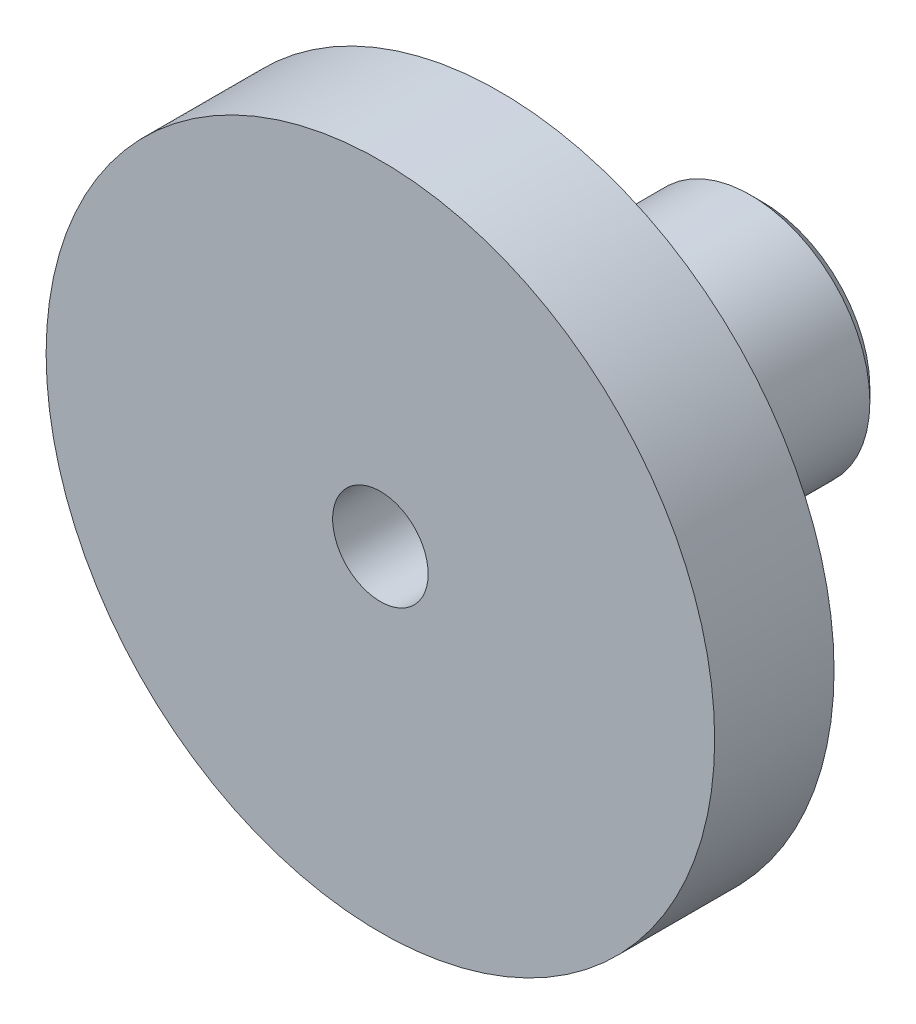
ISO-10303-21;
HEADER;
FILE_DESCRIPTION(('STEP AP214'),'2;1');
FILE_NAME('part.step','',(''),(''),'','','');
FILE_SCHEMA(('AUTOMOTIVE_DESIGN { 1 0 10303 214 1 1 1 1 }'));
ENDSEC;
DATA;
#1=APPLICATION_CONTEXT('core data for automotive mechanical design processes');
#2=APPLICATION_PROTOCOL_DEFINITION('international standard','automotive_design',2000,#1);
#3=PRODUCT_CONTEXT('',#1,'mechanical');
#4=PRODUCT('Part','Part','',(#3));
#5=PRODUCT_RELATED_PRODUCT_CATEGORY('part','',(#4));
#6=PRODUCT_DEFINITION_FORMATION('','',#4);
#7=PRODUCT_DEFINITION_CONTEXT('part definition',#1,'design');
#8=PRODUCT_DEFINITION('design','',#6,#7);
#9=PRODUCT_DEFINITION_SHAPE('','',#8);
#10=(LENGTH_UNIT() NAMED_UNIT(*) SI_UNIT(.MILLI.,.METRE.));
#11=(NAMED_UNIT(*) PLANE_ANGLE_UNIT() SI_UNIT($,.RADIAN.));
#12=(NAMED_UNIT(*) SI_UNIT($,.STERADIAN.) SOLID_ANGLE_UNIT());
#13=UNCERTAINTY_MEASURE_WITH_UNIT(LENGTH_MEASURE(1.E-05),#10,'distance_accuracy_value','');
#14=(GEOMETRIC_REPRESENTATION_CONTEXT(3) GLOBAL_UNCERTAINTY_ASSIGNED_CONTEXT((#13)) GLOBAL_UNIT_ASSIGNED_CONTEXT((#10,
#11,#12)) REPRESENTATION_CONTEXT('',''));
#15=CARTESIAN_POINT('',(0.,0.,0.));
#16=DIRECTION('',(0.,0.,1.));
#17=DIRECTION('',(1.,0.,0.));
#18=AXIS2_PLACEMENT_3D('',#15,#16,#17);
#19=CARTESIAN_POINT('',(0.,0.,-10.));
#20=DIRECTION('',(0.,0.,1.));
#21=DIRECTION('',(-1.,0.,0.));
#22=AXIS2_PLACEMENT_3D('',#19,#20,#21);
#23=CYLINDRICAL_SURFACE('',#22,28.);
#24=CARTESIAN_POINT('',(0.,0.,-10.));
#25=DIRECTION('',(0.,0.,1.));
#26=DIRECTION('',(1.,0.,0.));
#27=AXIS2_PLACEMENT_3D('',#24,#25,#26);
#28=CIRCLE('',#27,28.);
#29=CARTESIAN_POINT('',(28.,0.,-10.));
#30=VERTEX_POINT('',#29);
#31=EDGE_CURVE('E63',#30,#30,#28,.T.);
#32=ORIENTED_EDGE('',*,*,#31,.T.);
#33=EDGE_LOOP('',(#32));
#34=FACE_BOUND('',#33,.T.);
#35=CARTESIAN_POINT('',(0.,0.,0.));
#36=DIRECTION('',(0.,0.,1.));
#37=DIRECTION('',(1.,0.,0.));
#38=AXIS2_PLACEMENT_3D('',#35,#36,#37);
#39=CIRCLE('',#38,28.);
#40=CARTESIAN_POINT('',(28.,0.,0.));
#41=VERTEX_POINT('',#40);
#42=EDGE_CURVE('E64',#41,#41,#39,.T.);
#43=ORIENTED_EDGE('',*,*,#42,.F.);
#44=EDGE_LOOP('',(#43));
#45=FACE_BOUND('',#44,.T.);
#46=ADVANCED_FACE('F37',(#34,#45),#23,.T.);
#47=CARTESIAN_POINT('',(0.,0.,-10.));
#48=DIRECTION('',(0.,0.,-1.));
#49=DIRECTION('',(1.,0.,0.));
#50=AXIS2_PLACEMENT_3D('',#47,#48,#49);
#51=PLANE('',#50);
#52=CARTESIAN_POINT('',(0.,0.,-10.));
#53=DIRECTION('',(0.,0.,1.));
#54=DIRECTION('',(1.,0.,0.));
#55=AXIS2_PLACEMENT_3D('',#52,#53,#54);
#56=CIRCLE('',#55,11.);
#57=CARTESIAN_POINT('',(11.,0.,-10.));
#58=VERTEX_POINT('',#57);
#59=EDGE_CURVE('E10',#58,#58,#56,.F.);
#60=ORIENTED_EDGE('',*,*,#59,.F.);
#61=EDGE_LOOP('',(#60));
#62=FACE_BOUND('',#61,.T.);
#63=ORIENTED_EDGE('',*,*,#31,.F.);
#64=EDGE_LOOP('',(#63));
#65=FACE_BOUND('',#64,.T.);
#66=ADVANCED_FACE('F98',(#62,#65),#51,.T.);
#67=CARTESIAN_POINT('',(0.,0.,0.));
#68=DIRECTION('',(0.,0.,-1.));
#69=DIRECTION('',(1.,0.,0.));
#70=AXIS2_PLACEMENT_3D('',#67,#68,#69);
#71=PLANE('',#70);
#72=CARTESIAN_POINT('',(0.,0.,0.));
#73=DIRECTION('',(0.,0.,1.));
#74=DIRECTION('',(1.,0.,0.));
#75=AXIS2_PLACEMENT_3D('',#72,#73,#74);
#76=CIRCLE('',#75,4.);
#77=CARTESIAN_POINT('',(4.,0.,0.));
#78=VERTEX_POINT('',#77);
#79=EDGE_CURVE('E67',#78,#78,#76,.T.);
#80=ORIENTED_EDGE('',*,*,#79,.F.);
#81=EDGE_LOOP('',(#80));
#82=FACE_BOUND('',#81,.T.);
#83=ORIENTED_EDGE('',*,*,#42,.T.);
#84=EDGE_LOOP('',(#83));
#85=FACE_BOUND('',#84,.T.);
#86=ADVANCED_FACE('F95',(#82,#85),#71,.F.);
#87=CARTESIAN_POINT('',(0.,0.,-32.));
#88=DIRECTION('',(0.,0.,1.));
#89=DIRECTION('',(-1.,0.,0.));
#90=AXIS2_PLACEMENT_3D('',#87,#88,#89);
#91=CYLINDRICAL_SURFACE('',#90,10.);
#92=CARTESIAN_POINT('',(10.,0.,-20.35));
#93=CARTESIAN_POINT('',(9.99999843258099,-0.0920114531057513,-20.3500037009853));
#94=CARTESIAN_POINT('',(9.99871684765511,-0.184073454347173,-20.3577224586854));
#95=CARTESIAN_POINT('',(9.99372775496381,-0.36561632253533,-20.3883812351379));
#96=CARTESIAN_POINT('',(9.99001800272159,-0.455094721351769,-20.4113353369588));
#97=CARTESIAN_POINT('',(9.98058875631552,-0.628817487751617,-20.4717536389359));
#98=CARTESIAN_POINT('',(9.974870893487,-0.713066038744489,-20.5092060635603));
#99=CARTESIAN_POINT('',(9.96205444853338,-0.874072236504047,-20.5975272541486));
#100=CARTESIAN_POINT('',(9.95495602786423,-0.950830757653335,-20.648394451505));
#101=CARTESIAN_POINT('',(9.9400912001718,-1.09540879372213,-20.7626087771329));
#102=CARTESIAN_POINT('',(9.93231968689365,-1.1631478788234,-20.8260570636182));
#103=CARTESIAN_POINT('',(9.91702374723339,-1.28706950777736,-20.9634147735932));
#104=CARTESIAN_POINT('',(9.90949933632427,-1.3432513290959,-21.0373248506432));
#105=CARTESIAN_POINT('',(9.89550007731641,-1.44278500045255,-21.1940593436766));
#106=CARTESIAN_POINT('',(9.88903182722124,-1.486057495709,-21.2769347943439));
#107=CARTESIAN_POINT('',(9.87794796970923,-1.55803674048926,-21.4489026252365));
#108=CARTESIAN_POINT('',(9.87333223970889,-1.58674445381558,-21.5379945936492));
#109=CARTESIAN_POINT('',(9.86652679242373,-1.62852619503012,-21.719014582001));
#110=CARTESIAN_POINT('',(9.86431555933323,-1.64173895927954,-21.8109097556787));
#111=CARTESIAN_POINT('',(9.86250435770822,-1.6525858553069,-21.9956373659234));
#112=CARTESIAN_POINT('',(9.86290420804218,-1.65022106770363,-22.0884697370306));
#113=CARTESIAN_POINT('',(9.86625034802631,-1.63009303176281,-22.2714472770567));
#114=CARTESIAN_POINT('',(9.86917088684506,-1.61248549472491,-22.3616101140273));
#115=CARTESIAN_POINT('',(9.87718903199042,-1.56261607367814,-22.5376840705334));
#116=CARTESIAN_POINT('',(9.88228671162732,-1.53035369619842,-22.6235950467882));
#117=CARTESIAN_POINT('',(9.89411264039673,-1.45193210975576,-22.7891935299244));
#118=CARTESIAN_POINT('',(9.90084846298693,-1.40570810605855,-22.8688497892407));
#119=CARTESIAN_POINT('',(9.91518643931069,-1.30072141548382,-23.0193343239077));
#120=CARTESIAN_POINT('',(9.92278866158315,-1.24195773629992,-23.0901618999123));
#121=CARTESIAN_POINT('',(9.93811607123993,-1.11271072676608,-23.2218799788826));
#122=CARTESIAN_POINT('',(9.94584163094155,-1.04209376928229,-23.2826393946299));
#123=CARTESIAN_POINT('',(9.96045987838133,-0.891597059898627,-23.3914660216062));
#124=CARTESIAN_POINT('',(9.9673525609492,-0.81171725050342,-23.4395331540471));
#125=CARTESIAN_POINT('',(9.97953794169528,-0.644840083170818,-23.5216221505343));
#126=CARTESIAN_POINT('',(9.98482933722618,-0.557837003156625,-23.555632587638));
#127=CARTESIAN_POINT('',(9.99320544362233,-0.379246930002538,-23.6085219127753));
#128=CARTESIAN_POINT('',(9.99629033536768,-0.28766031326089,-23.6274020411448));
#129=CARTESIAN_POINT('',(9.99988156603306,-0.10363298381923,-23.6493174611612));
#130=CARTESIAN_POINT('',(10.0004171933872,-0.0112142564119049,-23.6525327361215));
#131=CARTESIAN_POINT('',(9.99892971175882,0.172841505554612,-23.6435068013197));
#132=CARTESIAN_POINT('',(9.99690669920295,0.264478569441094,-23.6312661740395));
#133=CARTESIAN_POINT('',(9.99054737820398,0.443814955541701,-23.5918255972229));
#134=CARTESIAN_POINT('',(9.98622483070292,0.531534371938234,-23.5647146056917));
#135=CARTESIAN_POINT('',(9.97574921956607,0.701182959294526,-23.4963976074449));
#136=CARTESIAN_POINT('',(9.96959605484328,0.783111810188923,-23.4551908223383));
#137=CARTESIAN_POINT('',(9.95606928426947,0.939636398877187,-23.359438680501));
#138=CARTESIAN_POINT('',(9.94868555427359,1.01416235726441,-23.3047807140829));
#139=CARTESIAN_POINT('',(9.93354765732488,1.15304841333202,-23.1838328509312));
#140=CARTESIAN_POINT('',(9.92579346406183,1.2174077875821,-23.1175421271457));
#141=CARTESIAN_POINT('',(9.91069407401677,1.33479962911466,-22.9744038936717));
#142=CARTESIAN_POINT('',(9.90335382329476,1.38771058951938,-22.8974561289012));
#143=CARTESIAN_POINT('',(9.89000528724129,1.47985547415611,-22.7356589529326));
#144=CARTESIAN_POINT('',(9.88399696030452,1.51908982562642,-22.6508097886681));
#145=CARTESIAN_POINT('',(9.87402953570154,1.58258535747081,-22.4759604675969));
#146=CARTESIAN_POINT('',(9.87006212213644,1.60690737863644,-22.3859829002034));
#147=CARTESIAN_POINT('',(9.86460473721113,1.64007952798871,-22.2031486882195));
#148=CARTESIAN_POINT('',(9.86311455516769,1.64893097191814,-22.1102922891519));
#149=CARTESIAN_POINT('',(9.86278931217107,1.65087457438791,-21.9255493586982));
#150=CARTESIAN_POINT('',(9.86392203182987,1.6441579678695,-21.8336648398079));
#151=CARTESIAN_POINT('',(9.86864441177183,1.61556925478543,-21.6523522481362));
#152=CARTESIAN_POINT('',(9.87223406454433,1.59369719454883,-21.5629241678464));
#153=CARTESIAN_POINT('',(9.88145370519206,1.53549112071354,-21.3891347575646));
#154=CARTESIAN_POINT('',(9.8870814149876,1.49917324977363,-21.3047678925491));
#155=CARTESIAN_POINT('',(9.89974533231771,1.41312606218932,-21.1432937331397));
#156=CARTESIAN_POINT('',(9.90678160742253,1.36339610211419,-21.0661867872723));
#157=CARTESIAN_POINT('',(9.92157214136343,1.25125259966704,-20.9204545023623));
#158=CARTESIAN_POINT('',(9.92933379899766,1.18869826623125,-20.8519382401805));
#159=CARTESIAN_POINT('',(9.94464125601211,1.05297867490408,-20.7263094001233));
#160=CARTESIAN_POINT('',(9.95218700513286,0.97981097009266,-20.6691994592198));
#161=CARTESIAN_POINT('',(9.96627143049841,0.824354696103038,-20.5676525774265));
#162=CARTESIAN_POINT('',(9.97280295936929,0.742007852048179,-20.523303852022));
#163=CARTESIAN_POINT('',(9.98405342047581,0.57095958692379,-20.4491366471937));
#164=CARTESIAN_POINT('',(9.98877416450827,0.482264623543759,-20.4193036358748));
#165=CARTESIAN_POINT('',(9.99483601455804,0.327682758240926,-20.3815206584732));
#166=CARTESIAN_POINT('',(9.99676220083327,0.262733066711098,-20.3697192511855));
#167=CARTESIAN_POINT('',(9.99934474465587,0.13186422762594,-20.3539576610669));
#168=CARTESIAN_POINT('',(10.0000011233775,0.0659450962546684,-20.3499973474842));
#169=CARTESIAN_POINT('',(10.,0.,-20.35));
#170=B_SPLINE_CURVE_WITH_KNOTS('',3,(#92,#93,#94,#95,#96,#97,#98,#99,#100,#101,#102,#103,#104,
#105,#106,#107,#108,#109,#110,#111,#112,#113,#114,#115,#116,#117,#118,#119,#120,#121,#122,#123,
#124,#125,#126,#127,#128,#129,#130,#131,#132,#133,#134,#135,#136,#137,#138,#139,#140,#141,#142,
#143,#144,#145,#146,#147,#148,#149,#150,#151,#152,#153,#154,#155,#156,#157,#158,#159,#160,#161,
#162,#163,#164,#165,#166,#167,#168,#169),.UNSPECIFIED.,.T.,.F.,(4,2,2,2,2,2,2,2,2,2,2,2,2,2,2,2,
2,2,2,2,2,2,2,2,2,2,2,2,2,2,2,2,2,2,2,2,2,2,4),(0.,0.275793319008918,0.551841928312972,
0.8276667998706,1.10345943314171,1.38156673144316,1.65969141110741,1.93949209608633,
2.21927426326044,2.49653175525206,2.77377001402269,3.04820914252877,3.32265751287872,
3.59839967320042,3.87416366201706,4.1532757240192,4.43238951858747,4.71172976565332,
4.991047110928,5.26714751096616,5.54323750600189,5.81769359979004,6.09216485190803,
6.36901711215385,6.64588906369257,6.92556925596458,7.20524071063227,7.48376340648032,
7.76226241335696,8.03735855216245,8.31245385002402,8.58724259883659,8.86204453269316,
9.14004258759617,9.41810483731131,9.69804546871317,9.97770526783281,10.1753710978727,
10.3730336317698),.UNSPECIFIED.);
#171=CARTESIAN_POINT('',(10.,0.,-20.35));
#172=VERTEX_POINT('',#171);
#173=EDGE_CURVE('E101',#172,#172,#170,.T.);
#174=ORIENTED_EDGE('',*,*,#173,.F.);
#175=EDGE_LOOP('',(#174));
#176=FACE_BOUND('',#175,.T.);
#177=CARTESIAN_POINT('',(0.,10.,-23.65));
#178=CARTESIAN_POINT('',(-0.0920114531057509,9.99999843258099,-23.6499962990147));
#179=CARTESIAN_POINT('',(-0.184073454347172,9.99871684765511,-23.6422775413146));
#180=CARTESIAN_POINT('',(-0.365616322535328,9.99372775496381,-23.6116187648621));
#181=CARTESIAN_POINT('',(-0.455094721351767,9.9900180027216,-23.5886646630412));
#182=CARTESIAN_POINT('',(-0.628817487751612,9.98058875631552,-23.5282463610641));
#183=CARTESIAN_POINT('',(-0.71306603874448,9.974870893487,-23.4907939364397));
#184=CARTESIAN_POINT('',(-0.874072236504036,9.96205444853338,-23.4024727458514));
#185=CARTESIAN_POINT('',(-0.950830757653324,9.95495602786423,-23.351605548495));
#186=CARTESIAN_POINT('',(-1.09540879372212,9.9400912001718,-23.2373912228671));
#187=CARTESIAN_POINT('',(-1.16314787882339,9.93231968689365,-23.1739429363817));
#188=CARTESIAN_POINT('',(-1.28706950777735,9.9170237472334,-23.0365852264068));
#189=CARTESIAN_POINT('',(-1.34325132909588,9.90949933632427,-22.9626751493568));
#190=CARTESIAN_POINT('',(-1.44278500045253,9.89550007731641,-22.8059406563233));
#191=CARTESIAN_POINT('',(-1.48605749570898,9.88903182722124,-22.7230652056561));
#192=CARTESIAN_POINT('',(-1.55803674048924,9.87794796970923,-22.5510973747635));
#193=CARTESIAN_POINT('',(-1.58674445381555,9.8733322397089,-22.4620054063507));
#194=CARTESIAN_POINT('',(-1.62852619503009,9.86652679242373,-22.280985417999));
#195=CARTESIAN_POINT('',(-1.64173895927951,9.86431555933323,-22.1890902443212));
#196=CARTESIAN_POINT('',(-1.65258585530686,9.86250435770823,-22.0043626340766));
#197=CARTESIAN_POINT('',(-1.65022106770359,9.86290420804218,-21.9115302629694));
#198=CARTESIAN_POINT('',(-1.63009303176277,9.86625034802632,-21.7285527229433));
#199=CARTESIAN_POINT('',(-1.61248549472487,9.86917088684506,-21.6383898859726));
#200=CARTESIAN_POINT('',(-1.56261607367809,9.87718903199043,-21.4623159294666));
#201=CARTESIAN_POINT('',(-1.53035369619838,9.88228671162733,-21.3764049532117));
#202=CARTESIAN_POINT('',(-1.45193210975571,9.89411264039674,-21.2108064700756));
#203=CARTESIAN_POINT('',(-1.4057081060585,9.90084846298694,-21.1311502107593));
#204=CARTESIAN_POINT('',(-1.30072141548377,9.9151864393107,-20.9806656760923));
#205=CARTESIAN_POINT('',(-1.24195773629987,9.92278866158316,-20.9098381000877));
#206=CARTESIAN_POINT('',(-1.11271072676603,9.93811607123993,-20.7781200211173));
#207=CARTESIAN_POINT('',(-1.04209376928222,9.94584163094155,-20.7173606053701));
#208=CARTESIAN_POINT('',(-0.891597059898563,9.96045987838133,-20.6085339783937));
#209=CARTESIAN_POINT('',(-0.811717250503355,9.9673525609492,-20.5604668459529));
#210=CARTESIAN_POINT('',(-0.644840083170752,9.97953794169528,-20.4783778494657));
#211=CARTESIAN_POINT('',(-0.557837003156558,9.98482933722619,-20.444367412362));
#212=CARTESIAN_POINT('',(-0.37924693000247,9.99320544362233,-20.3914780872247));
#213=CARTESIAN_POINT('',(-0.287660313260821,9.99629033536768,-20.3725979588552));
#214=CARTESIAN_POINT('',(-0.103632983819161,9.99988156603306,-20.3506825388388));
#215=CARTESIAN_POINT('',(-0.0112142564118364,10.0004171933872,-20.3474672638785));
#216=CARTESIAN_POINT('',(0.17284150555468,9.99892971175882,-20.3564931986803));
#217=CARTESIAN_POINT('',(0.264478569441162,9.99690669920295,-20.3687338259605));
#218=CARTESIAN_POINT('',(0.443814955541767,9.99054737820398,-20.4081744027771));
#219=CARTESIAN_POINT('',(0.531534371938299,9.98622483070291,-20.4352853943084));
#220=CARTESIAN_POINT('',(0.70118295929459,9.97574921956607,-20.5036023925551));
#221=CARTESIAN_POINT('',(0.783111810188987,9.96959605484327,-20.5448091776617));
#222=CARTESIAN_POINT('',(0.939636398877249,9.95606928426946,-20.640561319499));
#223=CARTESIAN_POINT('',(1.01416235726447,9.94868555427359,-20.6952192859171));
#224=CARTESIAN_POINT('',(1.15304841333208,9.93354765732487,-20.8161671490688));
#225=CARTESIAN_POINT('',(1.21740778758216,9.92579346406183,-20.8824578728543));
#226=CARTESIAN_POINT('',(1.33479962911471,9.91069407401676,-21.0255961063283));
#227=CARTESIAN_POINT('',(1.38771058951943,9.90335382329476,-21.1025438710988));
#228=CARTESIAN_POINT('',(1.47985547415616,9.89000528724129,-21.2643410470675));
#229=CARTESIAN_POINT('',(1.51908982562647,9.88399696030451,-21.3491902113319));
#230=CARTESIAN_POINT('',(1.58258535747086,9.87402953570153,-21.5240395324031));
#231=CARTESIAN_POINT('',(1.60690737863648,9.87006212213643,-21.6140170997967));
#232=CARTESIAN_POINT('',(1.64007952798875,9.86460473721113,-21.7968513117806));
#233=CARTESIAN_POINT('',(1.64893097191818,9.86311455516768,-21.8897077108482));
#234=CARTESIAN_POINT('',(1.65087457438795,9.86278931217107,-22.0744506413018));
#235=CARTESIAN_POINT('',(1.64415796786953,9.86392203182987,-22.1663351601921));
#236=CARTESIAN_POINT('',(1.61556925478546,9.86864441177183,-22.3476477518639));
#237=CARTESIAN_POINT('',(1.59369719454886,9.87223406454433,-22.4370758321536));
#238=CARTESIAN_POINT('',(1.53549112071356,9.88145370519205,-22.6108652424354));
#239=CARTESIAN_POINT('',(1.49917324977365,9.88708141498759,-22.695232107451));
#240=CARTESIAN_POINT('',(1.41312606218934,9.89974533231771,-22.8567062668603));
#241=CARTESIAN_POINT('',(1.36339610211421,9.90678160742252,-22.9338132127277));
#242=CARTESIAN_POINT('',(1.25125259966706,9.92157214136343,-23.0795454976377));
#243=CARTESIAN_POINT('',(1.18869826623126,9.92933379899765,-23.1480617598196));
#244=CARTESIAN_POINT('',(1.05297867490409,9.94464125601211,-23.2736905998767));
#245=CARTESIAN_POINT('',(0.979810970092669,9.95218700513286,-23.3308005407802));
#246=CARTESIAN_POINT('',(0.824354696103044,9.96627143049842,-23.4323474225735));
#247=CARTESIAN_POINT('',(0.742007852048184,9.97280295936929,-23.476696147978));
#248=CARTESIAN_POINT('',(0.570959586923792,9.98405342047581,-23.5508633528063));
#249=CARTESIAN_POINT('',(0.482264623543761,9.98877416450827,-23.5806963641252));
#250=CARTESIAN_POINT('',(0.327682758240928,9.99483601455804,-23.6184793415268));
#251=CARTESIAN_POINT('',(0.2627330667111,9.99676220083327,-23.6302807488145));
#252=CARTESIAN_POINT('',(0.131864227625941,9.99934474465587,-23.6460423389331));
#253=CARTESIAN_POINT('',(0.065945096254669,10.0000011233775,-23.6500026525158));
#254=CARTESIAN_POINT('',(0.,10.,-23.65));
#255=B_SPLINE_CURVE_WITH_KNOTS('',3,(#177,#178,#179,#180,#181,#182,#183,#184,#185,#186,#187,
#188,#189,#190,#191,#192,#193,#194,#195,#196,#197,#198,#199,#200,#201,#202,#203,#204,#205,#206,
#207,#208,#209,#210,#211,#212,#213,#214,#215,#216,#217,#218,#219,#220,#221,#222,#223,#224,#225,
#226,#227,#228,#229,#230,#231,#232,#233,#234,#235,#236,#237,#238,#239,#240,#241,#242,#243,#244,
#245,#246,#247,#248,#249,#250,#251,#252,#253,#254),.UNSPECIFIED.,.T.,.F.,(4,2,2,2,2,2,2,2,2,2,2,
2,2,2,2,2,2,2,2,2,2,2,2,2,2,2,2,2,2,2,2,2,2,2,2,2,2,2,4),(0.,0.275793319008917,
0.551841928312971,0.827666799870593,1.1034594331417,1.38156673144315,1.65969141110741,
1.93949209608633,2.21927426326044,2.49653175525206,2.77377001402269,3.04820914252876,
3.32265751287871,3.59839967320041,3.87416366201706,4.1532757240192,4.43238951858747,
4.71172976565331,4.991047110928,5.26714751096616,5.54323750600189,5.81769359979003,
6.09216485190802,6.36901711215385,6.64588906369257,6.92556925596458,7.20524071063227,
7.48376340648031,7.76226241335695,8.03735855216244,8.31245385002402,8.58724259883658,
8.86204453269315,9.14004258759616,9.4181048373113,9.69804546871317,9.9777052678328,
10.1753710978727,10.3730336317698),.UNSPECIFIED.);
#256=CARTESIAN_POINT('',(0.,10.,-23.65));
#257=VERTEX_POINT('',#256);
#258=EDGE_CURVE('E72',#257,#257,#255,.T.);
#259=ORIENTED_EDGE('',*,*,#258,.F.);
#260=EDGE_LOOP('',(#259));
#261=FACE_BOUND('',#260,.T.);
#262=CARTESIAN_POINT('',(0.,0.,-11.));
#263=DIRECTION('',(0.,0.,1.));
#264=DIRECTION('',(1.,0.,0.));
#265=AXIS2_PLACEMENT_3D('',#262,#263,#264);
#266=CIRCLE('',#265,10.);
#267=CARTESIAN_POINT('',(10.,0.,-11.));
#268=VERTEX_POINT('',#267);
#269=EDGE_CURVE('E44',#268,#268,#266,.T.);
#270=ORIENTED_EDGE('',*,*,#269,.F.);
#271=EDGE_LOOP('',(#270));
#272=FACE_BOUND('',#271,.T.);
#273=CARTESIAN_POINT('',(0.,0.,-31.));
#274=DIRECTION('',(0.,0.,1.));
#275=DIRECTION('',(1.,0.,0.));
#276=AXIS2_PLACEMENT_3D('',#273,#274,#275);
#277=CIRCLE('',#276,10.);
#278=CARTESIAN_POINT('',(10.,0.,-31.));
#279=VERTEX_POINT('',#278);
#280=EDGE_CURVE('E48',#279,#279,#277,.F.);
#281=ORIENTED_EDGE('',*,*,#280,.F.);
#282=EDGE_LOOP('',(#281));
#283=FACE_BOUND('',#282,.T.);
#284=ADVANCED_FACE('F89',(#176,#261,#272,#283),#91,.T.);
#285=CARTESIAN_POINT('',(0.,0.,-32.));
#286=DIRECTION('',(0.,0.,-1.));
#287=DIRECTION('',(1.,0.,0.));
#288=AXIS2_PLACEMENT_3D('',#285,#286,#287);
#289=PLANE('',#288);
#290=CARTESIAN_POINT('',(0.,0.,-32.));
#291=DIRECTION('',(0.,0.,1.));
#292=DIRECTION('',(1.,0.,0.));
#293=AXIS2_PLACEMENT_3D('',#290,#291,#292);
#294=CIRCLE('',#293,5.00000000000001);
#295=CARTESIAN_POINT('',(5.00000000000001,0.,-32.));
#296=VERTEX_POINT('',#295);
#297=EDGE_CURVE('E52',#296,#296,#294,.F.);
#298=ORIENTED_EDGE('',*,*,#297,.F.);
#299=EDGE_LOOP('',(#298));
#300=FACE_BOUND('',#299,.T.);
#301=CARTESIAN_POINT('',(0.,0.,-32.));
#302=DIRECTION('',(0.,0.,1.));
#303=DIRECTION('',(1.,0.,0.));
#304=AXIS2_PLACEMENT_3D('',#301,#302,#303);
#305=CIRCLE('',#304,9.);
#306=CARTESIAN_POINT('',(9.,0.,-32.));
#307=VERTEX_POINT('',#306);
#308=EDGE_CURVE('E57',#307,#307,#305,.T.);
#309=ORIENTED_EDGE('',*,*,#308,.F.);
#310=EDGE_LOOP('',(#309));
#311=FACE_BOUND('',#310,.T.);
#312=ADVANCED_FACE('F94',(#300,#311),#289,.T.);
#313=CARTESIAN_POINT('',(0.,0.,0.));
#314=DIRECTION('',(0.,0.,-1.));
#315=DIRECTION('',(1.,0.,0.));
#316=AXIS2_PLACEMENT_3D('',#313,#314,#315);
#317=CYLINDRICAL_SURFACE('',#316,4.);
#318=CARTESIAN_POINT('',(4.,0.,-20.35));
#319=CARTESIAN_POINT('',(3.99999309817074,0.0884596783632789,-20.3500092172066));
#320=CARTESIAN_POINT('',(3.99703145792172,0.177062252057582,-20.3571560143433));
#321=CARTESIAN_POINT('',(3.9854711320255,0.351759669836408,-20.3854911419369));
#322=CARTESIAN_POINT('',(3.97685757767607,0.437847271996958,-20.4067165110243));
#323=CARTESIAN_POINT('',(3.95491965529936,0.604702496902737,-20.4622948122019));
#324=CARTESIAN_POINT('',(3.94161112398211,0.685486934491192,-20.4966036433535));
#325=CARTESIAN_POINT('',(3.91158286286531,0.840076633223481,-20.5771947578495));
#326=CARTESIAN_POINT('',(3.89486420463244,0.913884076117558,-20.6234732811702));
#327=CARTESIAN_POINT('',(3.85876900012149,1.05618769598524,-20.7291067546441));
#328=CARTESIAN_POINT('',(3.83930654387258,1.12429373957475,-20.788957670249));
#329=CARTESIAN_POINT('',(3.80029483347099,1.24983574384756,-20.918988839659));
#330=CARTESIAN_POINT('',(3.78074553976623,1.30726618926956,-20.9891743992118));
#331=CARTESIAN_POINT('',(3.74272551686067,1.41254826809048,-21.1419682488717));
#332=CARTESIAN_POINT('',(3.72435159658093,1.45980781790559,-21.2250111153066));
#333=CARTESIAN_POINT('',(3.69212136090387,1.53951358199404,-21.3987363092902));
#334=CARTESIAN_POINT('',(3.67826276509116,1.57196727712788,-21.4894147513631));
#335=CARTESIAN_POINT('',(3.65756021871624,1.61953738222489,-21.6713479970019));
#336=CARTESIAN_POINT('',(3.65041449103238,1.6354037141715,-21.7623710721431));
#337=CARTESIAN_POINT('',(3.64307714795705,1.65168918120799,-21.9460465073653));
#338=CARTESIAN_POINT('',(3.6428818057274,1.65211659473996,-22.0386979676293));
#339=CARTESIAN_POINT('',(3.64921138579607,1.63807780779826,-22.2155988866188));
#340=CARTESIAN_POINT('',(3.65523439741042,1.62472398487454,-22.2999581587492));
#341=CARTESIAN_POINT('',(3.67247532251839,1.58536484231193,-22.4651102843812));
#342=CARTESIAN_POINT('',(3.68369420783861,1.5593571558718,-22.5459024676033));
#343=CARTESIAN_POINT('',(3.71031458481433,1.49492412942483,-22.7036451087586));
#344=CARTESIAN_POINT('',(3.72579923184193,1.45624866973011,-22.7804787378084));
#345=CARTESIAN_POINT('',(3.75918616236909,1.36775445443618,-22.9268602324601));
#346=CARTESIAN_POINT('',(3.77708938726887,1.31793135478153,-22.9964052422492));
#347=CARTESIAN_POINT('',(3.81509742396097,1.20371911924862,-23.1322864077878));
#348=CARTESIAN_POINT('',(3.83526188253692,1.13846630094382,-23.1978819577033));
#349=CARTESIAN_POINT('',(3.87426910607355,0.997682554866143,-23.3174446744414));
#350=CARTESIAN_POINT('',(3.89311157289531,0.922149319847359,-23.3714092238609));
#351=CARTESIAN_POINT('',(3.92787932271739,0.760736369737248,-23.4672347735851));
#352=CARTESIAN_POINT('',(3.94373050716792,0.67466409407216,-23.5088002831942));
#353=CARTESIAN_POINT('',(3.97016319816606,0.495928253552899,-23.5766030241089));
#354=CARTESIAN_POINT('',(3.98074755693755,0.403268287372308,-23.6028485532112));
#355=CARTESIAN_POINT('',(3.99492450637935,0.220181304317597,-23.6377295036782));
#356=CARTESIAN_POINT('',(3.99891121146316,0.129974172308146,-23.6473591779359));
#357=CARTESIAN_POINT('',(4.00069746426785,-0.0508474401522959,-23.6516920437633));
#358=CARTESIAN_POINT('',(3.99849874371343,-0.141461799500638,-23.6463994131082));
#359=CARTESIAN_POINT('',(3.98841747083846,-0.315907755487618,-23.621754731757));
#360=CARTESIAN_POINT('',(3.98081531688809,-0.399855317526753,-23.6030959266599));
#361=CARTESIAN_POINT('',(3.9609888780309,-0.563340473329641,-23.5532079036629));
#362=CARTESIAN_POINT('',(3.94876400644331,-0.642877505872212,-23.5219770901852));
#363=CARTESIAN_POINT('',(3.92039728883463,-0.798061975964539,-23.4468106200191));
#364=CARTESIAN_POINT('',(3.90414585630854,-0.87351265666057,-23.4025114382438));
#365=CARTESIAN_POINT('',(3.86946768187547,-1.01617847320913,-23.3028660657421));
#366=CARTESIAN_POINT('',(3.85104004134397,-1.08339018342116,-23.2475153049101));
#367=CARTESIAN_POINT('',(3.81240295844538,-1.21261994292747,-23.122795695188));
#368=CARTESIAN_POINT('',(3.7921591649383,-1.27394364561828,-23.0527161759607));
#369=CARTESIAN_POINT('',(3.75333928940829,-1.38414835482511,-22.9029287093914));
#370=CARTESIAN_POINT('',(3.73476355904107,-1.43302674162732,-22.8232187400574));
#371=CARTESIAN_POINT('',(3.70128700339841,-1.51742282291392,-22.6549046294666));
#372=CARTESIAN_POINT('',(3.68643724424494,-1.55275802936539,-22.5661980839919));
#373=CARTESIAN_POINT('',(3.66281640168179,-1.60769618165397,-22.3832908340217));
#374=CARTESIAN_POINT('',(3.65404044124934,-1.62731175174757,-22.2890946035818));
#375=CARTESIAN_POINT('',(3.64429559365238,-1.64901123940271,-22.1055697268419));
#376=CARTESIAN_POINT('',(3.64278573581522,-1.65231049364128,-22.016412780542));
#377=CARTESIAN_POINT('',(3.64631178238902,-1.6445148535657,-21.8388715292408));
#378=CARTESIAN_POINT('',(3.65134672892695,-1.63342206561732,-21.7504871130806));
#379=CARTESIAN_POINT('',(3.66690490418699,-1.59817118006574,-21.5810669287423));
#380=CARTESIAN_POINT('',(3.6771726120025,-1.57461958437456,-21.4998792885779));
#381=CARTESIAN_POINT('',(3.70184411206583,-1.51570599472929,-21.3425854775259));
#382=CARTESIAN_POINT('',(3.7162490615217,-1.48034069596894,-21.2664807357024));
#383=CARTESIAN_POINT('',(3.7486340889516,-1.39638062253792,-21.1165779617586));
#384=CARTESIAN_POINT('',(3.76677577854002,-1.34712443599272,-21.0431859289786));
#385=CARTESIAN_POINT('',(3.80412864636709,-1.23771718137823,-20.9053283127357));
#386=CARTESIAN_POINT('',(3.82334018195056,-1.17756245772963,-20.8408657372256));
#387=CARTESIAN_POINT('',(3.86230172013188,-1.04300738755744,-20.7180058612963));
#388=CARTESIAN_POINT('',(3.88199359359226,-0.967900110730178,-20.6603607763945));
#389=CARTESIAN_POINT('',(3.91832426905579,-0.808343463182033,-20.5584598404613));
#390=CARTESIAN_POINT('',(3.9349616732268,-0.723889843442849,-20.5142101136341));
#391=CARTESIAN_POINT('',(3.96305691394126,-0.549414760109626,-20.4413362601652));
#392=CARTESIAN_POINT('',(3.97459855421812,-0.459513381649423,-20.4124575746414));
#393=CARTESIAN_POINT('',(3.99154438775475,-0.27571922921324,-20.3704889152149));
#394=CARTESIAN_POINT('',(3.99696786149576,-0.181839966818027,-20.3573493337546));
#395=CARTESIAN_POINT('',(3.99968194626838,-0.0584442952271949,-20.35077322967));
#396=CARTESIAN_POINT('',(4.00000228058838,-0.0292299486703373,-20.3499969543358));
#397=CARTESIAN_POINT('',(4.,0.,-20.35));
#398=B_SPLINE_CURVE_WITH_KNOTS('',3,(#318,#319,#320,#321,#322,#323,#324,#325,#326,#327,#328,
#329,#330,#331,#332,#333,#334,#335,#336,#337,#338,#339,#340,#341,#342,#343,#344,#345,#346,#347,
#348,#349,#350,#351,#352,#353,#354,#355,#356,#357,#358,#359,#360,#361,#362,#363,#364,#365,#366,
#367,#368,#369,#370,#371,#372,#373,#374,#375,#376,#377,#378,#379,#380,#381,#382,#383,#384,#385,
#386,#387,#388,#389,#390,#391,#392,#393,#394,#395,#396,#397),.UNSPECIFIED.,.T.,.F.,(4,2,2,2,2,2,
2,2,2,2,2,2,2,2,2,2,2,2,2,2,2,2,2,2,2,2,2,2,2,2,2,2,2,2,2,2,2,2,2,4),(0.,0.26529709877062,
0.531294937906659,0.79640398149888,1.06142984766523,1.33841878994456,1.61555043582129,
1.90598404924538,2.19627075414924,2.4727764853942,2.74913395037958,3.00480633611682,
3.26052656166859,3.5216353930134,3.78284615202014,4.06565185095455,4.34852112528508,
4.63767392136375,4.92666995726766,5.19768149557684,5.46861716672803,5.72643264660552,
5.98428085748382,6.25011488704504,6.51605907418431,6.80064580250401,7.08529238632157,
7.3736498522578,7.66177550895674,7.92807823226722,8.19434198489782,8.44869772098557,
8.70312467109942,8.97267479984707,9.24231550885211,9.5310408581654,9.81989801073176,
10.1038095613048,10.3868238858898,10.4744866574818),.UNSPECIFIED.);
#399=CARTESIAN_POINT('',(4.,0.,-20.35));
#400=VERTEX_POINT('',#399);
#401=EDGE_CURVE('E108',#400,#400,#398,.T.);
#402=ORIENTED_EDGE('',*,*,#401,.F.);
#403=EDGE_LOOP('',(#402));
#404=FACE_BOUND('',#403,.T.);
#405=CARTESIAN_POINT('',(0.,4.,-23.65));
#406=CARTESIAN_POINT('',(0.0884596783632783,3.99999309817074,-23.6499907827934));
#407=CARTESIAN_POINT('',(0.177062252057581,3.99703145792172,-23.6428439856567));
#408=CARTESIAN_POINT('',(0.351759669836407,3.9854711320255,-23.6145088580631));
#409=CARTESIAN_POINT('',(0.437847271996959,3.97685757767606,-23.5932834889757));
#410=CARTESIAN_POINT('',(0.604702496902738,3.95491965529936,-23.5377051877981));
#411=CARTESIAN_POINT('',(0.685486934491192,3.94161112398211,-23.5033963566465));
#412=CARTESIAN_POINT('',(0.840076633223482,3.91158286286531,-23.4228052421506));
#413=CARTESIAN_POINT('',(0.913884076117562,3.89486420463244,-23.3765267188298));
#414=CARTESIAN_POINT('',(1.05618769598525,3.85876900012149,-23.2708932453559));
#415=CARTESIAN_POINT('',(1.12429373957476,3.83930654387258,-23.211042329751));
#416=CARTESIAN_POINT('',(1.24983574384756,3.80029483347099,-23.081011160341));
#417=CARTESIAN_POINT('',(1.30726618926956,3.78074553976622,-23.0108256007882));
#418=CARTESIAN_POINT('',(1.41254826809049,3.74272551686067,-22.8580317511283));
#419=CARTESIAN_POINT('',(1.45980781790561,3.72435159658093,-22.7749888846935));
#420=CARTESIAN_POINT('',(1.53951358199406,3.69212136090386,-22.6012636907098));
#421=CARTESIAN_POINT('',(1.5719672771279,3.67826276509115,-22.510585248637));
#422=CARTESIAN_POINT('',(1.61953738222491,3.65756021871623,-22.3286520029982));
#423=CARTESIAN_POINT('',(1.63540371417153,3.65041449103237,-22.2376289278569));
#424=CARTESIAN_POINT('',(1.65168918120802,3.64307714795703,-22.0539534926347));
#425=CARTESIAN_POINT('',(1.65211659474,3.64288180572738,-21.9613020323707));
#426=CARTESIAN_POINT('',(1.6380778077983,3.64921138579605,-21.7844011133813));
#427=CARTESIAN_POINT('',(1.62472398487458,3.6552343974104,-21.7000418412508));
#428=CARTESIAN_POINT('',(1.58536484231197,3.67247532251837,-21.5348897156188));
#429=CARTESIAN_POINT('',(1.55935715587184,3.68369420783859,-21.4540975323967));
#430=CARTESIAN_POINT('',(1.49492412942488,3.71031458481431,-21.2963548912414));
#431=CARTESIAN_POINT('',(1.45624866973016,3.72579923184191,-21.2195212621917));
#432=CARTESIAN_POINT('',(1.36775445443624,3.75918616236907,-21.07313976754));
#433=CARTESIAN_POINT('',(1.31793135478159,3.77708938726885,-21.0035947577509));
#434=CARTESIAN_POINT('',(1.20371911924869,3.81509742396095,-20.8677135922122));
#435=CARTESIAN_POINT('',(1.13846630094388,3.8352618825369,-20.8021180422967));
#436=CARTESIAN_POINT('',(0.997682554866212,3.87426910607353,-20.6825553255586));
#437=CARTESIAN_POINT('',(0.922149319847431,3.8931115728953,-20.6285907761392));
#438=CARTESIAN_POINT('',(0.760736369737323,3.92787932271737,-20.532765226415));
#439=CARTESIAN_POINT('',(0.674664094072236,3.94373050716791,-20.4911997168058));
#440=CARTESIAN_POINT('',(0.495928253552977,3.97016319816605,-20.4233969758911));
#441=CARTESIAN_POINT('',(0.403268287372385,3.98074755693754,-20.3971514467888));
#442=CARTESIAN_POINT('',(0.220181304317674,3.99492450637935,-20.3622704963218));
#443=CARTESIAN_POINT('',(0.129974172308223,3.99891121146315,-20.3526408220641));
#444=CARTESIAN_POINT('',(-0.0508474401522209,4.00069746426785,-20.3483079562367));
#445=CARTESIAN_POINT('',(-0.141461799500565,3.99849874371343,-20.3536005868918));
#446=CARTESIAN_POINT('',(-0.315907755487546,3.98841747083847,-20.378245268243));
#447=CARTESIAN_POINT('',(-0.399855317526683,3.9808153168881,-20.3969040733401));
#448=CARTESIAN_POINT('',(-0.563340473329572,3.96098887803091,-20.4467920963371));
#449=CARTESIAN_POINT('',(-0.642877505872143,3.94876400644332,-20.4780229098148));
#450=CARTESIAN_POINT('',(-0.798061975964472,3.92039728883464,-20.5531893799809));
#451=CARTESIAN_POINT('',(-0.873512656660503,3.90414585630856,-20.5974885617562));
#452=CARTESIAN_POINT('',(-1.01617847320907,3.86946768187548,-20.6971339342579));
#453=CARTESIAN_POINT('',(-1.0833901834211,3.85104004134398,-20.7524846950898));
#454=CARTESIAN_POINT('',(-1.21261994292741,3.8124029584454,-20.877204304812));
#455=CARTESIAN_POINT('',(-1.27394364561821,3.79215916493832,-20.9472838240393));
#456=CARTESIAN_POINT('',(-1.38414835482505,3.75333928940831,-21.0970712906085));
#457=CARTESIAN_POINT('',(-1.43302674162726,3.73476355904109,-21.1767812599426));
#458=CARTESIAN_POINT('',(-1.51742282291387,3.70128700339843,-21.3450953705333));
#459=CARTESIAN_POINT('',(-1.55275802936534,3.68643724424496,-21.4338019160081));
#460=CARTESIAN_POINT('',(-1.60769618165393,3.66281640168181,-21.6167091659782));
#461=CARTESIAN_POINT('',(-1.62731175174752,3.65404044124936,-21.7109053964182));
#462=CARTESIAN_POINT('',(-1.64901123940267,3.64429559365239,-21.8944302731581));
#463=CARTESIAN_POINT('',(-1.65231049364124,3.64278573581524,-21.9835872194579));
#464=CARTESIAN_POINT('',(-1.64451485356567,3.64631178238903,-22.1611284707592));
#465=CARTESIAN_POINT('',(-1.63342206561729,3.65134672892697,-22.2495128869194));
#466=CARTESIAN_POINT('',(-1.59817118006571,3.666904904187,-22.4189330712577));
#467=CARTESIAN_POINT('',(-1.57461958437453,3.67717261200251,-22.5001207114221));
#468=CARTESIAN_POINT('',(-1.51570599472927,3.70184411206584,-22.6574145224741));
#469=CARTESIAN_POINT('',(-1.48034069596892,3.71624906152171,-22.7335192642976));
#470=CARTESIAN_POINT('',(-1.3963806225379,3.7486340889516,-22.8834220382414));
#471=CARTESIAN_POINT('',(-1.34712443599271,3.76677577854003,-22.9568140710214));
#472=CARTESIAN_POINT('',(-1.23771718137822,3.80412864636709,-23.0946716872643));
#473=CARTESIAN_POINT('',(-1.17756245772962,3.82334018195057,-23.1591342627744));
#474=CARTESIAN_POINT('',(-1.04300738755743,3.86230172013188,-23.2819941387037));
#475=CARTESIAN_POINT('',(-0.967900110730173,3.88199359359226,-23.3396392236055));
#476=CARTESIAN_POINT('',(-0.808343463182031,3.91832426905579,-23.4415401595387));
#477=CARTESIAN_POINT('',(-0.723889843442847,3.9349616732268,-23.4857898863659));
#478=CARTESIAN_POINT('',(-0.549414760109625,3.96305691394126,-23.5586637398347));
#479=CARTESIAN_POINT('',(-0.459513381649424,3.97459855421812,-23.5875424253585));
#480=CARTESIAN_POINT('',(-0.275719229213242,3.99154438775475,-23.6295110847851));
#481=CARTESIAN_POINT('',(-0.18183996681803,3.99696786149576,-23.6426506662454));
#482=CARTESIAN_POINT('',(-0.0584442952271974,3.99968194626838,-23.64922677033));
#483=CARTESIAN_POINT('',(-0.0292299486703385,4.00000228058838,-23.6500030456642));
#484=CARTESIAN_POINT('',(0.,4.,-23.65));
#485=B_SPLINE_CURVE_WITH_KNOTS('',3,(#405,#406,#407,#408,#409,#410,#411,#412,#413,#414,#415,
#416,#417,#418,#419,#420,#421,#422,#423,#424,#425,#426,#427,#428,#429,#430,#431,#432,#433,#434,
#435,#436,#437,#438,#439,#440,#441,#442,#443,#444,#445,#446,#447,#448,#449,#450,#451,#452,#453,
#454,#455,#456,#457,#458,#459,#460,#461,#462,#463,#464,#465,#466,#467,#468,#469,#470,#471,#472,
#473,#474,#475,#476,#477,#478,#479,#480,#481,#482,#483,#484),.UNSPECIFIED.,.T.,.F.,(4,2,2,2,2,2,
2,2,2,2,2,2,2,2,2,2,2,2,2,2,2,2,2,2,2,2,2,2,2,2,2,2,2,2,2,2,2,2,2,4),(0.,0.265297098770618,
0.531294937906658,0.796403981498876,1.06142984766522,1.33841878994456,1.61555043582129,
1.90598404924537,2.19627075414924,2.4727764853942,2.74913395037959,3.00480633611682,
3.2605265616686,3.5216353930134,3.78284615202013,4.06565185095454,4.34852112528507,
4.63767392136374,4.92666995726766,5.19768149557684,5.46861716672803,5.72643264660552,
5.98428085748382,6.25011488704504,6.5160590741843,6.800645802504,7.08529238632156,
7.37364985225779,7.66177550895673,7.92807823226721,8.19434198489782,8.44869772098557,
8.70312467109942,8.97267479984707,9.2423155088521,9.53104085816539,9.81989801073176,
10.1038095613048,10.3868238858898,10.4744866574817),.UNSPECIFIED.);
#486=CARTESIAN_POINT('',(0.,4.,-23.65));
#487=VERTEX_POINT('',#486);
#488=EDGE_CURVE('E80',#487,#487,#485,.T.);
#489=ORIENTED_EDGE('',*,*,#488,.F.);
#490=EDGE_LOOP('',(#489));
#491=FACE_BOUND('',#490,.T.);
#492=CARTESIAN_POINT('',(0.,0.,-31.));
#493=DIRECTION('',(0.,0.,1.));
#494=DIRECTION('',(1.,0.,0.));
#495=AXIS2_PLACEMENT_3D('',#492,#493,#494);
#496=CIRCLE('',#495,4.);
#497=CARTESIAN_POINT('',(4.,0.,-31.));
#498=VERTEX_POINT('',#497);
#499=EDGE_CURVE('E60',#498,#498,#496,.T.);
#500=ORIENTED_EDGE('',*,*,#499,.F.);
#501=EDGE_LOOP('',(#500));
#502=FACE_BOUND('',#501,.T.);
#503=ORIENTED_EDGE('',*,*,#79,.T.);
#504=EDGE_LOOP('',(#503));
#505=FACE_BOUND('',#504,.T.);
#506=ADVANCED_FACE('F136',(#404,#491,#502,#505),#317,.F.);
#507=CARTESIAN_POINT('',(0.,0.,-31.));
#508=DIRECTION('',(0.,0.,-1.));
#509=DIRECTION('',(1.,0.,0.));
#510=AXIS2_PLACEMENT_3D('',#507,#508,#509);
#511=CONICAL_SURFACE('',#510,4.,0.785398163397452);
#512=ORIENTED_EDGE('',*,*,#297,.T.);
#513=EDGE_LOOP('',(#512));
#514=FACE_BOUND('',#513,.T.);
#515=ORIENTED_EDGE('',*,*,#499,.T.);
#516=EDGE_LOOP('',(#515));
#517=FACE_BOUND('',#516,.T.);
#518=ADVANCED_FACE('F133',(#514,#517),#511,.F.);
#519=CARTESIAN_POINT('',(0.,0.,-11.));
#520=DIRECTION('',(0.,0.,1.));
#521=DIRECTION('',(-1.,0.,0.));
#522=AXIS2_PLACEMENT_3D('',#519,#520,#521);
#523=CONICAL_SURFACE('',#522,10.,0.785398163397446);
#524=ORIENTED_EDGE('',*,*,#59,.T.);
#525=EDGE_LOOP('',(#524));
#526=FACE_BOUND('',#525,.T.);
#527=ORIENTED_EDGE('',*,*,#269,.T.);
#528=EDGE_LOOP('',(#527));
#529=FACE_BOUND('',#528,.T.);
#530=ADVANCED_FACE('F135',(#526,#529),#523,.T.);
#531=CARTESIAN_POINT('',(0.,0.,-32.));
#532=DIRECTION('',(0.,0.,1.));
#533=DIRECTION('',(-1.,0.,0.));
#534=AXIS2_PLACEMENT_3D('',#531,#532,#533);
#535=CONICAL_SURFACE('',#534,9.,0.785398163397447);
#536=ORIENTED_EDGE('',*,*,#280,.T.);
#537=EDGE_LOOP('',(#536));
#538=FACE_BOUND('',#537,.T.);
#539=ORIENTED_EDGE('',*,*,#308,.T.);
#540=EDGE_LOOP('',(#539));
#541=FACE_BOUND('',#540,.T.);
#542=ADVANCED_FACE('F39',(#538,#541),#535,.T.);
#543=CARTESIAN_POINT('',(0.,10.,-22.));
#544=DIRECTION('',(0.,1.,0.));
#545=DIRECTION('',(0.,0.,-1.));
#546=AXIS2_PLACEMENT_3D('',#543,#544,#545);
#547=CYLINDRICAL_SURFACE('',#546,1.64999999999999);
#548=ORIENTED_EDGE('',*,*,#488,.T.);
#549=EDGE_LOOP('',(#548));
#550=FACE_BOUND('',#549,.T.);
#551=ORIENTED_EDGE('',*,*,#258,.T.);
#552=EDGE_LOOP('',(#551));
#553=FACE_BOUND('',#552,.T.);
#554=ADVANCED_FACE('F86',(#550,#553),#547,.F.);
#555=CARTESIAN_POINT('',(10.,0.,-22.));
#556=DIRECTION('',(1.,0.,0.));
#557=DIRECTION('',(0.,0.,1.));
#558=AXIS2_PLACEMENT_3D('',#555,#556,#557);
#559=CYLINDRICAL_SURFACE('',#558,1.64999999999999);
#560=ORIENTED_EDGE('',*,*,#401,.T.);
#561=EDGE_LOOP('',(#560));
#562=FACE_BOUND('',#561,.T.);
#563=ORIENTED_EDGE('',*,*,#173,.T.);
#564=EDGE_LOOP('',(#563));
#565=FACE_BOUND('',#564,.T.);
#566=ADVANCED_FACE('F112',(#562,#565),#559,.F.);
#567=CLOSED_SHELL('',(#46,#66,#86,#284,#312,#506,#518,#530,#542,#554,#566));
#568=MANIFOLD_SOLID_BREP('B2',#567);
#569=ADVANCED_BREP_SHAPE_REPRESENTATION('',(#18,#568),#14);
#570=SHAPE_DEFINITION_REPRESENTATION(#9,#569);
ENDSEC;
END-ISO-10303-21;
